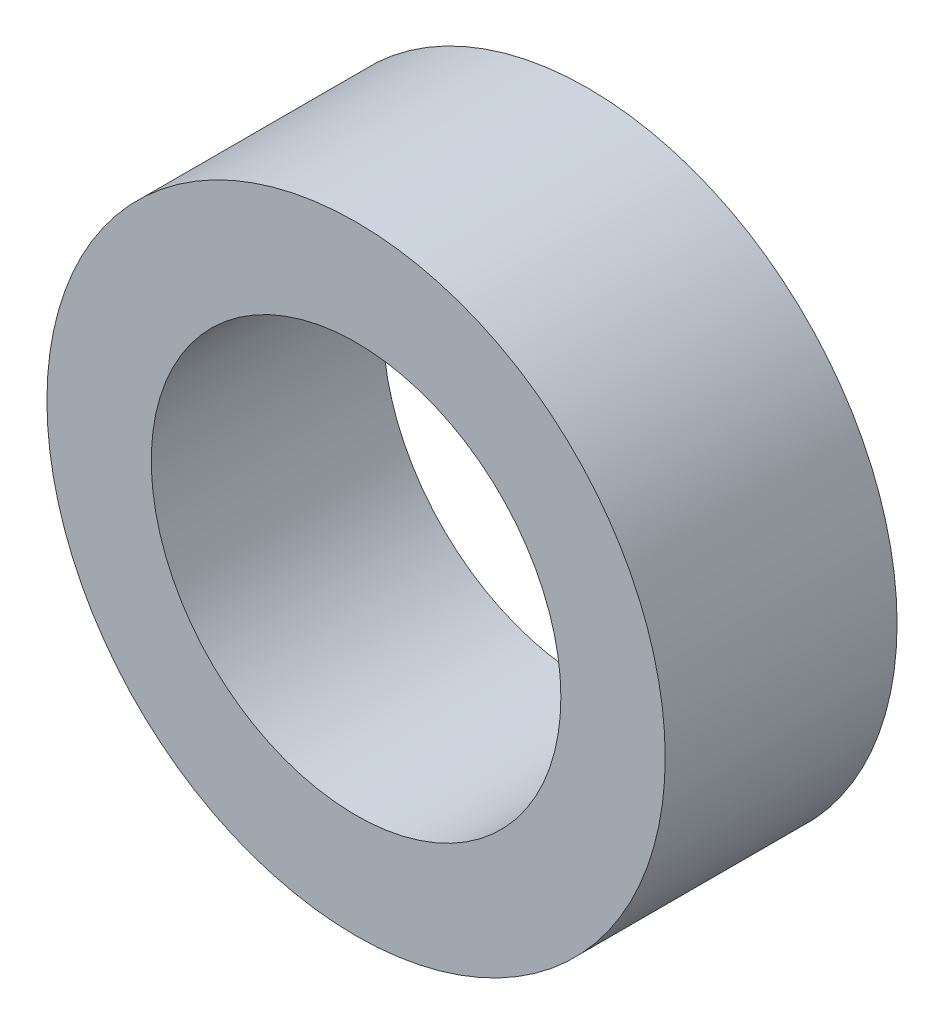
ISO-10303-21;
HEADER;
FILE_DESCRIPTION(('STEP AP214'),'2;1');
FILE_NAME('part.step','',(''),(''),'','','');
FILE_SCHEMA(('AUTOMOTIVE_DESIGN { 1 0 10303 214 1 1 1 1 }'));
ENDSEC;
DATA;
#1=APPLICATION_CONTEXT('core data for automotive mechanical design processes');
#2=APPLICATION_PROTOCOL_DEFINITION('international standard','automotive_design',2000,#1);
#3=PRODUCT_CONTEXT('',#1,'mechanical');
#4=PRODUCT('Part','Part','',(#3));
#5=PRODUCT_RELATED_PRODUCT_CATEGORY('part','',(#4));
#6=PRODUCT_DEFINITION_FORMATION('','',#4);
#7=PRODUCT_DEFINITION_CONTEXT('part definition',#1,'design');
#8=PRODUCT_DEFINITION('design','',#6,#7);
#9=PRODUCT_DEFINITION_SHAPE('','',#8);
#10=(LENGTH_UNIT() NAMED_UNIT(*) SI_UNIT(.MILLI.,.METRE.));
#11=(NAMED_UNIT(*) PLANE_ANGLE_UNIT() SI_UNIT($,.RADIAN.));
#12=(NAMED_UNIT(*) SI_UNIT($,.STERADIAN.) SOLID_ANGLE_UNIT());
#13=UNCERTAINTY_MEASURE_WITH_UNIT(LENGTH_MEASURE(1.E-05),#10,'distance_accuracy_value','');
#14=(GEOMETRIC_REPRESENTATION_CONTEXT(3) GLOBAL_UNCERTAINTY_ASSIGNED_CONTEXT((#13)) GLOBAL_UNIT_ASSIGNED_CONTEXT((#10,
#11,#12)) REPRESENTATION_CONTEXT('',''));
#15=CARTESIAN_POINT('',(0.,0.,0.));
#16=DIRECTION('',(0.,0.,1.));
#17=DIRECTION('',(1.,0.,0.));
#18=AXIS2_PLACEMENT_3D('',#15,#16,#17);
#19=CARTESIAN_POINT('',(0.,0.,1.5));
#20=DIRECTION('',(0.,0.,1.));
#21=DIRECTION('',(1.,0.,0.));
#22=AXIS2_PLACEMENT_3D('',#19,#20,#21);
#23=PLANE('',#22);
#24=CARTESIAN_POINT('',(0.,0.,1.5));
#25=DIRECTION('',(0.,0.,1.));
#26=DIRECTION('',(1.,0.,0.));
#27=AXIS2_PLACEMENT_3D('',#24,#25,#26);
#28=CIRCLE('',#27,4.);
#29=CARTESIAN_POINT('',(4.,0.,1.5));
#30=VERTEX_POINT('',#29);
#31=EDGE_CURVE('E10',#30,#30,#28,.T.);
#32=ORIENTED_EDGE('',*,*,#31,.T.);
#33=EDGE_LOOP('',(#32));
#34=FACE_BOUND('',#33,.T.);
#35=CARTESIAN_POINT('',(0.,0.,1.5));
#36=DIRECTION('',(0.,0.,1.));
#37=DIRECTION('',(1.,0.,0.));
#38=AXIS2_PLACEMENT_3D('',#35,#36,#37);
#39=CIRCLE('',#38,2.65);
#40=CARTESIAN_POINT('',(2.65,0.,1.5));
#41=VERTEX_POINT('',#40);
#42=EDGE_CURVE('E41',#41,#41,#39,.T.);
#43=ORIENTED_EDGE('',*,*,#42,.F.);
#44=EDGE_LOOP('',(#43));
#45=FACE_BOUND('',#44,.T.);
#46=ADVANCED_FACE('F30',(#34,#45),#23,.T.);
#47=CARTESIAN_POINT('',(0.,0.,-1.5));
#48=DIRECTION('',(0.,0.,1.));
#49=DIRECTION('',(1.,0.,0.));
#50=AXIS2_PLACEMENT_3D('',#47,#48,#49);
#51=PLANE('',#50);
#52=CARTESIAN_POINT('',(0.,0.,-1.5));
#53=DIRECTION('',(0.,0.,1.));
#54=DIRECTION('',(1.,0.,0.));
#55=AXIS2_PLACEMENT_3D('',#52,#53,#54);
#56=CIRCLE('',#55,4.);
#57=CARTESIAN_POINT('',(4.,0.,-1.5));
#58=VERTEX_POINT('',#57);
#59=EDGE_CURVE('E34',#58,#58,#56,.T.);
#60=ORIENTED_EDGE('',*,*,#59,.F.);
#61=EDGE_LOOP('',(#60));
#62=FACE_BOUND('',#61,.T.);
#63=CARTESIAN_POINT('',(0.,0.,-1.5));
#64=DIRECTION('',(0.,0.,1.));
#65=DIRECTION('',(1.,0.,0.));
#66=AXIS2_PLACEMENT_3D('',#63,#64,#65);
#67=CIRCLE('',#66,2.65);
#68=CARTESIAN_POINT('',(2.65,0.,-1.5));
#69=VERTEX_POINT('',#68);
#70=EDGE_CURVE('E43',#69,#69,#67,.T.);
#71=ORIENTED_EDGE('',*,*,#70,.T.);
#72=EDGE_LOOP('',(#71));
#73=FACE_BOUND('',#72,.T.);
#74=ADVANCED_FACE('F53',(#62,#73),#51,.F.);
#75=CARTESIAN_POINT('',(0.,0.,1.5));
#76=DIRECTION('',(0.,0.,-1.));
#77=DIRECTION('',(-1.,0.,0.));
#78=AXIS2_PLACEMENT_3D('',#75,#76,#77);
#79=CYLINDRICAL_SURFACE('',#78,4.);
#80=ORIENTED_EDGE('',*,*,#31,.F.);
#81=EDGE_LOOP('',(#80));
#82=FACE_BOUND('',#81,.T.);
#83=ORIENTED_EDGE('',*,*,#59,.T.);
#84=EDGE_LOOP('',(#83));
#85=FACE_BOUND('',#84,.T.);
#86=ADVANCED_FACE('F32',(#82,#85),#79,.T.);
#87=CARTESIAN_POINT('',(0.,0.,1.5));
#88=DIRECTION('',(0.,0.,-1.));
#89=DIRECTION('',(-1.,0.,0.));
#90=AXIS2_PLACEMENT_3D('',#87,#88,#89);
#91=CYLINDRICAL_SURFACE('',#90,2.65);
#92=ORIENTED_EDGE('',*,*,#42,.T.);
#93=EDGE_LOOP('',(#92));
#94=FACE_BOUND('',#93,.T.);
#95=ORIENTED_EDGE('',*,*,#70,.F.);
#96=EDGE_LOOP('',(#95));
#97=FACE_BOUND('',#96,.T.);
#98=ADVANCED_FACE('F49',(#94,#97),#91,.F.);
#99=CLOSED_SHELL('',(#46,#74,#86,#98));
#100=MANIFOLD_SOLID_BREP('B2',#99);
#101=ADVANCED_BREP_SHAPE_REPRESENTATION('',(#18,#100),#14);
#102=SHAPE_DEFINITION_REPRESENTATION(#9,#101);
ENDSEC;
END-ISO-10303-21;
